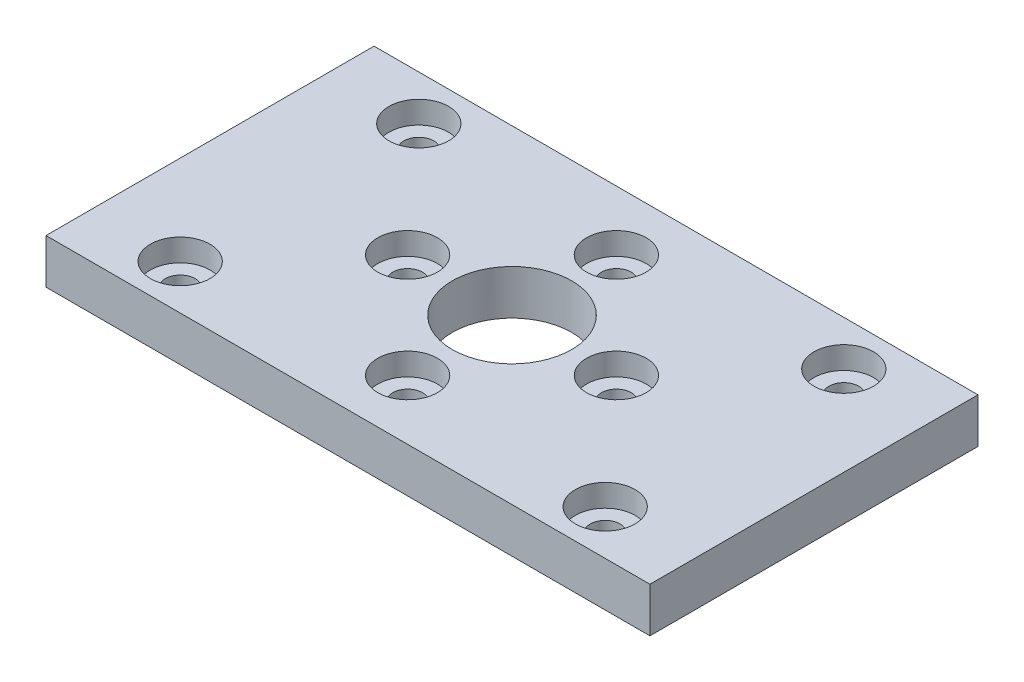
ISO-10303-21;
HEADER;
FILE_DESCRIPTION(('STEP AP214'),'2;1');
FILE_NAME('part.step','',(''),(''),'','','');
FILE_SCHEMA(('AUTOMOTIVE_DESIGN { 1 0 10303 214 1 1 1 1 }'));
ENDSEC;
DATA;
#1=APPLICATION_CONTEXT('core data for automotive mechanical design processes');
#2=APPLICATION_PROTOCOL_DEFINITION('international standard','automotive_design',2000,#1);
#3=PRODUCT_CONTEXT('',#1,'mechanical');
#4=PRODUCT('Part','Part','',(#3));
#5=PRODUCT_RELATED_PRODUCT_CATEGORY('part','',(#4));
#6=PRODUCT_DEFINITION_FORMATION('','',#4);
#7=PRODUCT_DEFINITION_CONTEXT('part definition',#1,'design');
#8=PRODUCT_DEFINITION('design','',#6,#7);
#9=PRODUCT_DEFINITION_SHAPE('','',#8);
#10=(LENGTH_UNIT() NAMED_UNIT(*) SI_UNIT(.MILLI.,.METRE.));
#11=(NAMED_UNIT(*) PLANE_ANGLE_UNIT() SI_UNIT($,.RADIAN.));
#12=(NAMED_UNIT(*) SI_UNIT($,.STERADIAN.) SOLID_ANGLE_UNIT());
#13=UNCERTAINTY_MEASURE_WITH_UNIT(LENGTH_MEASURE(1.E-05),#10,'distance_accuracy_value','');
#14=(GEOMETRIC_REPRESENTATION_CONTEXT(3) GLOBAL_UNCERTAINTY_ASSIGNED_CONTEXT((#13)) GLOBAL_UNIT_ASSIGNED_CONTEXT((#10,
#11,#12)) REPRESENTATION_CONTEXT('',''));
#15=CARTESIAN_POINT('',(0.,0.,0.));
#16=DIRECTION('',(0.,0.,1.));
#17=DIRECTION('',(1.,0.,0.));
#18=AXIS2_PLACEMENT_3D('',#15,#16,#17);
#19=CARTESIAN_POINT('',(14.25,-7.,8.));
#20=DIRECTION('',(0.,1.,0.));
#21=DIRECTION('',(0.,0.,1.));
#22=AXIS2_PLACEMENT_3D('',#19,#20,#21);
#23=CYLINDRICAL_SURFACE('',#22,1.);
#24=CARTESIAN_POINT('',(14.25,0.,8.));
#25=DIRECTION('',(0.,-1.,0.));
#26=DIRECTION('',(0.,0.,-1.));
#27=AXIS2_PLACEMENT_3D('',#24,#25,#26);
#28=CIRCLE('',#27,1.);
#29=CARTESIAN_POINT('',(14.25,0.,7.));
#30=VERTEX_POINT('',#29);
#31=EDGE_CURVE('E116',#30,#30,#28,.T.);
#32=ORIENTED_EDGE('',*,*,#31,.T.);
#33=EDGE_LOOP('',(#32));
#34=FACE_BOUND('',#33,.T.);
#35=CARTESIAN_POINT('',(14.25,1.5,8.));
#36=DIRECTION('',(0.,1.,0.));
#37=DIRECTION('',(0.,0.,1.));
#38=AXIS2_PLACEMENT_3D('',#35,#36,#37);
#39=CIRCLE('',#38,1.);
#40=CARTESIAN_POINT('',(14.25,1.5,9.));
#41=VERTEX_POINT('',#40);
#42=EDGE_CURVE('E156',#41,#41,#39,.F.);
#43=ORIENTED_EDGE('',*,*,#42,.F.);
#44=EDGE_LOOP('',(#43));
#45=FACE_BOUND('',#44,.T.);
#46=ADVANCED_FACE('F34',(#34,#45),#23,.F.);
#47=CARTESIAN_POINT('',(-14.25,-7.,8.));
#48=DIRECTION('',(0.,1.,0.));
#49=DIRECTION('',(0.,0.,1.));
#50=AXIS2_PLACEMENT_3D('',#47,#48,#49);
#51=CYLINDRICAL_SURFACE('',#50,1.);
#52=CARTESIAN_POINT('',(-14.25,0.,8.));
#53=DIRECTION('',(0.,-1.,0.));
#54=DIRECTION('',(0.,0.,-1.));
#55=AXIS2_PLACEMENT_3D('',#52,#53,#54);
#56=CIRCLE('',#55,1.);
#57=CARTESIAN_POINT('',(-14.25,0.,7.));
#58=VERTEX_POINT('',#57);
#59=EDGE_CURVE('E112',#58,#58,#56,.T.);
#60=ORIENTED_EDGE('',*,*,#59,.T.);
#61=EDGE_LOOP('',(#60));
#62=FACE_BOUND('',#61,.T.);
#63=CARTESIAN_POINT('',(-14.25,1.5,8.));
#64=DIRECTION('',(0.,1.,0.));
#65=DIRECTION('',(0.,0.,1.));
#66=AXIS2_PLACEMENT_3D('',#63,#64,#65);
#67=CIRCLE('',#66,1.);
#68=CARTESIAN_POINT('',(-14.25,1.5,9.));
#69=VERTEX_POINT('',#68);
#70=EDGE_CURVE('E154',#69,#69,#67,.F.);
#71=ORIENTED_EDGE('',*,*,#70,.F.);
#72=EDGE_LOOP('',(#71));
#73=FACE_BOUND('',#72,.T.);
#74=ADVANCED_FACE('F194',(#62,#73),#51,.F.);
#75=CARTESIAN_POINT('',(-6.9999999999998,-7.,1.98951966012828E-13));
#76=DIRECTION('',(0.,1.,0.));
#77=DIRECTION('',(0.,0.,1.));
#78=AXIS2_PLACEMENT_3D('',#75,#76,#77);
#79=CYLINDRICAL_SURFACE('',#78,1.00000000000032);
#80=CARTESIAN_POINT('',(-6.9999999999998,0.,1.98951966012828E-13));
#81=DIRECTION('',(0.,-1.,0.));
#82=DIRECTION('',(0.,0.,-1.));
#83=AXIS2_PLACEMENT_3D('',#80,#81,#82);
#84=CIRCLE('',#83,1.00000000000032);
#85=CARTESIAN_POINT('',(-6.9999999999998,0.,-1.00000000000012));
#86=VERTEX_POINT('',#85);
#87=EDGE_CURVE('E129',#86,#86,#84,.T.);
#88=ORIENTED_EDGE('',*,*,#87,.T.);
#89=EDGE_LOOP('',(#88));
#90=FACE_BOUND('',#89,.T.);
#91=CARTESIAN_POINT('',(-6.9999999999998,1.5,1.98951966012828E-13));
#92=DIRECTION('',(0.,1.,0.));
#93=DIRECTION('',(0.,0.,1.));
#94=AXIS2_PLACEMENT_3D('',#91,#92,#93);
#95=CIRCLE('',#94,1.00000000000032);
#96=CARTESIAN_POINT('',(-6.9999999999998,1.5,1.00000000000052));
#97=VERTEX_POINT('',#96);
#98=EDGE_CURVE('E148',#97,#97,#95,.F.);
#99=ORIENTED_EDGE('',*,*,#98,.F.);
#100=EDGE_LOOP('',(#99));
#101=FACE_BOUND('',#100,.T.);
#102=ADVANCED_FACE('F200',(#90,#101),#79,.F.);
#103=CARTESIAN_POINT('',(3.9618942650685E-13,-7.,7.));
#104=DIRECTION('',(0.,1.,0.));
#105=DIRECTION('',(0.,0.,1.));
#106=AXIS2_PLACEMENT_3D('',#103,#104,#105);
#107=CYLINDRICAL_SURFACE('',#106,1.00000000000043);
#108=CARTESIAN_POINT('',(3.9618942650685E-13,0.,7.));
#109=DIRECTION('',(0.,-1.,0.));
#110=DIRECTION('',(0.,0.,-1.));
#111=AXIS2_PLACEMENT_3D('',#108,#109,#110);
#112=CIRCLE('',#111,1.00000000000043);
#113=CARTESIAN_POINT('',(3.9618942650685E-13,0.,5.99999999999957));
#114=VERTEX_POINT('',#113);
#115=EDGE_CURVE('E132',#114,#114,#112,.T.);
#116=ORIENTED_EDGE('',*,*,#115,.T.);
#117=EDGE_LOOP('',(#116));
#118=FACE_BOUND('',#117,.T.);
#119=CARTESIAN_POINT('',(3.9618942650685E-13,1.5,7.));
#120=DIRECTION('',(0.,1.,0.));
#121=DIRECTION('',(0.,0.,1.));
#122=AXIS2_PLACEMENT_3D('',#119,#120,#121);
#123=CIRCLE('',#122,1.00000000000043);
#124=CARTESIAN_POINT('',(3.9618942650685E-13,1.5,8.00000000000042));
#125=VERTEX_POINT('',#124);
#126=EDGE_CURVE('E144',#125,#125,#123,.F.);
#127=ORIENTED_EDGE('',*,*,#126,.F.);
#128=EDGE_LOOP('',(#127));
#129=FACE_BOUND('',#128,.T.);
#130=ADVANCED_FACE('F224',(#118,#129),#107,.F.);
#131=CARTESIAN_POINT('',(7.0000000000002,-7.,-1.98094713253425E-13));
#132=DIRECTION('',(0.,1.,0.));
#133=DIRECTION('',(0.,0.,1.));
#134=AXIS2_PLACEMENT_3D('',#131,#132,#133);
#135=CYLINDRICAL_SURFACE('',#134,1.00000000000015);
#136=CARTESIAN_POINT('',(7.0000000000002,0.,-1.98094713253425E-13));
#137=DIRECTION('',(0.,-1.,0.));
#138=DIRECTION('',(0.,0.,-1.));
#139=AXIS2_PLACEMENT_3D('',#136,#137,#138);
#140=CIRCLE('',#139,1.00000000000015);
#141=CARTESIAN_POINT('',(7.0000000000002,0.,-1.00000000000035));
#142=VERTEX_POINT('',#141);
#143=EDGE_CURVE('E128',#142,#142,#140,.T.);
#144=ORIENTED_EDGE('',*,*,#143,.T.);
#145=EDGE_LOOP('',(#144));
#146=FACE_BOUND('',#145,.T.);
#147=CARTESIAN_POINT('',(7.0000000000002,1.5,-1.98094713253425E-13));
#148=DIRECTION('',(0.,1.,0.));
#149=DIRECTION('',(0.,0.,1.));
#150=AXIS2_PLACEMENT_3D('',#147,#148,#149);
#151=CIRCLE('',#150,1.00000000000015);
#152=CARTESIAN_POINT('',(7.0000000000002,1.5,0.999999999999957));
#153=VERTEX_POINT('',#152);
#154=EDGE_CURVE('E141',#153,#153,#151,.F.);
#155=ORIENTED_EDGE('',*,*,#154,.F.);
#156=EDGE_LOOP('',(#155));
#157=FACE_BOUND('',#156,.T.);
#158=ADVANCED_FACE('F219',(#146,#157),#135,.F.);
#159=CARTESIAN_POINT('',(20.25,3.,11.));
#160=DIRECTION('',(-1.,0.,0.));
#161=DIRECTION('',(0.,0.,1.));
#162=AXIS2_PLACEMENT_3D('',#159,#160,#161);
#163=PLANE('',#162);
#164=DIRECTION('',(0.,0.,-1.));
#165=VECTOR('',#164,1.);
#166=CARTESIAN_POINT('',(20.25,0.,11.));
#167=LINE('',#166,#165);
#168=CARTESIAN_POINT('',(20.25,0.,11.));
#169=VERTEX_POINT('',#168);
#170=CARTESIAN_POINT('',(20.25,0.,-11.));
#171=VERTEX_POINT('',#170);
#172=EDGE_CURVE('E101',#169,#171,#167,.T.);
#173=ORIENTED_EDGE('',*,*,#172,.T.);
#174=DIRECTION('',(0.,-1.,0.));
#175=VECTOR('',#174,1.);
#176=CARTESIAN_POINT('',(20.25,3.,-11.));
#177=LINE('',#176,#175);
#178=CARTESIAN_POINT('',(20.25,3.,-11.));
#179=VERTEX_POINT('',#178);
#180=EDGE_CURVE('E11',#179,#171,#177,.T.);
#181=ORIENTED_EDGE('',*,*,#180,.F.);
#182=DIRECTION('',(0.,0.,-1.));
#183=VECTOR('',#182,1.);
#184=CARTESIAN_POINT('',(20.25,3.,11.));
#185=LINE('',#184,#183);
#186=CARTESIAN_POINT('',(20.25,3.,11.));
#187=VERTEX_POINT('',#186);
#188=EDGE_CURVE('E88',#187,#179,#185,.T.);
#189=ORIENTED_EDGE('',*,*,#188,.F.);
#190=DIRECTION('',(0.,-1.,0.));
#191=VECTOR('',#190,1.);
#192=CARTESIAN_POINT('',(20.25,3.,11.));
#193=LINE('',#192,#191);
#194=EDGE_CURVE('E97',#187,#169,#193,.T.);
#195=ORIENTED_EDGE('',*,*,#194,.T.);
#196=EDGE_LOOP('',(#173,#181,#189,#195));
#197=FACE_BOUND('',#196,.T.);
#198=ADVANCED_FACE('F36',(#197),#163,.F.);
#199=CARTESIAN_POINT('',(-20.25,3.,-11.));
#200=DIRECTION('',(0.,0.,1.));
#201=DIRECTION('',(1.,0.,0.));
#202=AXIS2_PLACEMENT_3D('',#199,#200,#201);
#203=PLANE('',#202);
#204=DIRECTION('',(-1.,0.,0.));
#205=VECTOR('',#204,1.);
#206=CARTESIAN_POINT('',(-20.25,0.,-11.));
#207=LINE('',#206,#205);
#208=CARTESIAN_POINT('',(-20.25,0.,-11.));
#209=VERTEX_POINT('',#208);
#210=EDGE_CURVE('E92',#171,#209,#207,.T.);
#211=ORIENTED_EDGE('',*,*,#210,.T.);
#212=DIRECTION('',(0.,-1.,0.));
#213=VECTOR('',#212,1.);
#214=CARTESIAN_POINT('',(-20.25,3.,-11.));
#215=LINE('',#214,#213);
#216=CARTESIAN_POINT('',(-20.25,3.,-11.));
#217=VERTEX_POINT('',#216);
#218=EDGE_CURVE('E44',#217,#209,#215,.T.);
#219=ORIENTED_EDGE('',*,*,#218,.F.);
#220=DIRECTION('',(-1.,0.,0.));
#221=VECTOR('',#220,1.);
#222=CARTESIAN_POINT('',(-20.25,3.,-11.));
#223=LINE('',#222,#221);
#224=EDGE_CURVE('E83',#179,#217,#223,.T.);
#225=ORIENTED_EDGE('',*,*,#224,.F.);
#226=ORIENTED_EDGE('',*,*,#180,.T.);
#227=EDGE_LOOP('',(#211,#219,#225,#226));
#228=FACE_BOUND('',#227,.T.);
#229=ADVANCED_FACE('F91',(#228),#203,.F.);
#230=CARTESIAN_POINT('',(-20.25,3.,11.));
#231=DIRECTION('',(1.,0.,0.));
#232=DIRECTION('',(0.,0.,-1.));
#233=AXIS2_PLACEMENT_3D('',#230,#231,#232);
#234=PLANE('',#233);
#235=DIRECTION('',(0.,0.,1.));
#236=VECTOR('',#235,1.);
#237=CARTESIAN_POINT('',(-20.25,0.,11.));
#238=LINE('',#237,#236);
#239=CARTESIAN_POINT('',(-20.25,0.,11.));
#240=VERTEX_POINT('',#239);
#241=EDGE_CURVE('E70',#209,#240,#238,.T.);
#242=ORIENTED_EDGE('',*,*,#241,.T.);
#243=DIRECTION('',(0.,-1.,0.));
#244=VECTOR('',#243,1.);
#245=CARTESIAN_POINT('',(-20.25,3.,11.));
#246=LINE('',#245,#244);
#247=CARTESIAN_POINT('',(-20.25,3.,11.));
#248=VERTEX_POINT('',#247);
#249=EDGE_CURVE('E93',#248,#240,#246,.T.);
#250=ORIENTED_EDGE('',*,*,#249,.F.);
#251=DIRECTION('',(0.,0.,1.));
#252=VECTOR('',#251,1.);
#253=CARTESIAN_POINT('',(-20.25,3.,11.));
#254=LINE('',#253,#252);
#255=EDGE_CURVE('E86',#217,#248,#254,.T.);
#256=ORIENTED_EDGE('',*,*,#255,.F.);
#257=ORIENTED_EDGE('',*,*,#218,.T.);
#258=EDGE_LOOP('',(#242,#250,#256,#257));
#259=FACE_BOUND('',#258,.T.);
#260=ADVANCED_FACE('F95',(#259),#234,.F.);
#261=CARTESIAN_POINT('',(-20.25,3.,11.));
#262=DIRECTION('',(0.,0.,-1.));
#263=DIRECTION('',(-1.,0.,0.));
#264=AXIS2_PLACEMENT_3D('',#261,#262,#263);
#265=PLANE('',#264);
#266=DIRECTION('',(1.,0.,0.));
#267=VECTOR('',#266,1.);
#268=CARTESIAN_POINT('',(-20.25,0.,11.));
#269=LINE('',#268,#267);
#270=EDGE_CURVE('E76',#240,#169,#269,.T.);
#271=ORIENTED_EDGE('',*,*,#270,.T.);
#272=ORIENTED_EDGE('',*,*,#194,.F.);
#273=DIRECTION('',(1.,0.,0.));
#274=VECTOR('',#273,1.);
#275=CARTESIAN_POINT('',(-20.25,3.,11.));
#276=LINE('',#275,#274);
#277=EDGE_CURVE('E53',#248,#187,#276,.T.);
#278=ORIENTED_EDGE('',*,*,#277,.F.);
#279=ORIENTED_EDGE('',*,*,#249,.T.);
#280=EDGE_LOOP('',(#271,#272,#278,#279));
#281=FACE_BOUND('',#280,.T.);
#282=ADVANCED_FACE('F179',(#281),#265,.F.);
#283=CARTESIAN_POINT('',(0.,3.,0.));
#284=DIRECTION('',(0.,-1.,0.));
#285=DIRECTION('',(0.,0.,-1.));
#286=AXIS2_PLACEMENT_3D('',#283,#284,#285);
#287=PLANE('',#286);
#288=CARTESIAN_POINT('',(-14.25,3.,8.));
#289=DIRECTION('',(0.,1.,0.));
#290=DIRECTION('',(0.,0.,1.));
#291=AXIS2_PLACEMENT_3D('',#288,#289,#290);
#292=CIRCLE('',#291,2.);
#293=CARTESIAN_POINT('',(-14.25,3.,10.));
#294=VERTEX_POINT('',#293);
#295=EDGE_CURVE('E416',#294,#294,#292,.T.);
#296=ORIENTED_EDGE('',*,*,#295,.F.);
#297=EDGE_LOOP('',(#296));
#298=FACE_BOUND('',#297,.T.);
#299=CARTESIAN_POINT('',(3.9618942650685E-13,3.,7.));
#300=DIRECTION('',(0.,1.,0.));
#301=DIRECTION('',(0.,0.,1.));
#302=AXIS2_PLACEMENT_3D('',#299,#300,#301);
#303=CIRCLE('',#302,2.);
#304=CARTESIAN_POINT('',(3.9618942650685E-13,3.,9.));
#305=VERTEX_POINT('',#304);
#306=EDGE_CURVE('E422',#305,#305,#303,.T.);
#307=ORIENTED_EDGE('',*,*,#306,.F.);
#308=EDGE_LOOP('',(#307));
#309=FACE_BOUND('',#308,.T.);
#310=CARTESIAN_POINT('',(14.25,3.,8.));
#311=DIRECTION('',(0.,1.,0.));
#312=DIRECTION('',(0.,0.,1.));
#313=AXIS2_PLACEMENT_3D('',#310,#311,#312);
#314=CIRCLE('',#313,2.);
#315=CARTESIAN_POINT('',(14.25,3.,10.));
#316=VERTEX_POINT('',#315);
#317=EDGE_CURVE('E409',#316,#316,#314,.T.);
#318=ORIENTED_EDGE('',*,*,#317,.F.);
#319=EDGE_LOOP('',(#318));
#320=FACE_BOUND('',#319,.T.);
#321=CARTESIAN_POINT('',(-14.2500000000001,3.,-7.99999999999969));
#322=DIRECTION('',(0.,1.,0.));
#323=DIRECTION('',(0.,0.,-1.));
#324=AXIS2_PLACEMENT_3D('',#321,#322,#323);
#325=CIRCLE('',#324,2.);
#326=CARTESIAN_POINT('',(-14.2500000000001,3.,-9.99999999999969));
#327=VERTEX_POINT('',#326);
#328=EDGE_CURVE('E406',#327,#327,#325,.T.);
#329=ORIENTED_EDGE('',*,*,#328,.F.);
#330=EDGE_LOOP('',(#329));
#331=FACE_BOUND('',#330,.T.);
#332=CARTESIAN_POINT('',(-6.9999999999998,3.,1.98951966012828E-13));
#333=DIRECTION('',(0.,1.,0.));
#334=DIRECTION('',(0.,0.,1.));
#335=AXIS2_PLACEMENT_3D('',#332,#333,#334);
#336=CIRCLE('',#335,2.);
#337=CARTESIAN_POINT('',(-6.9999999999998,3.,2.0000000000002));
#338=VERTEX_POINT('',#337);
#339=EDGE_CURVE('E415',#338,#338,#336,.T.);
#340=ORIENTED_EDGE('',*,*,#339,.F.);
#341=EDGE_LOOP('',(#340));
#342=FACE_BOUND('',#341,.T.);
#343=CARTESIAN_POINT('',(7.0000000000002,3.,-1.98094713253425E-13));
#344=DIRECTION('',(0.,1.,0.));
#345=DIRECTION('',(0.,0.,1.));
#346=AXIS2_PLACEMENT_3D('',#343,#344,#345);
#347=CIRCLE('',#346,2.);
#348=CARTESIAN_POINT('',(7.0000000000002,3.,1.9999999999998));
#349=VERTEX_POINT('',#348);
#350=EDGE_CURVE('E434',#349,#349,#347,.T.);
#351=ORIENTED_EDGE('',*,*,#350,.F.);
#352=EDGE_LOOP('',(#351));
#353=FACE_BOUND('',#352,.T.);
#354=CARTESIAN_POINT('',(3.40678275275592E-13,3.,-6.99999999999981));
#355=DIRECTION('',(0.,1.,0.));
#356=DIRECTION('',(0.,0.,-1.));
#357=AXIS2_PLACEMENT_3D('',#354,#355,#356);
#358=CIRCLE('',#357,2.);
#359=CARTESIAN_POINT('',(3.40678275275592E-13,3.,-8.99999999999981));
#360=VERTEX_POINT('',#359);
#361=EDGE_CURVE('E428',#360,#360,#358,.T.);
#362=ORIENTED_EDGE('',*,*,#361,.F.);
#363=EDGE_LOOP('',(#362));
#364=FACE_BOUND('',#363,.T.);
#365=CARTESIAN_POINT('',(14.2499999999999,3.,-7.99999999999992));
#366=DIRECTION('',(0.,1.,0.));
#367=DIRECTION('',(0.,0.,-1.));
#368=AXIS2_PLACEMENT_3D('',#365,#366,#367);
#369=CIRCLE('',#368,2.);
#370=CARTESIAN_POINT('',(14.2499999999999,3.,-9.99999999999991));
#371=VERTEX_POINT('',#370);
#372=EDGE_CURVE('E161',#371,#371,#369,.T.);
#373=ORIENTED_EDGE('',*,*,#372,.F.);
#374=EDGE_LOOP('',(#373));
#375=FACE_BOUND('',#374,.T.);
#376=CARTESIAN_POINT('',(0.,3.,0.));
#377=DIRECTION('',(0.,1.,0.));
#378=DIRECTION('',(0.,0.,1.));
#379=AXIS2_PLACEMENT_3D('',#376,#377,#378);
#380=CIRCLE('',#379,4.);
#381=CARTESIAN_POINT('',(0.,3.,4.));
#382=VERTEX_POINT('',#381);
#383=EDGE_CURVE('E124',#382,#382,#380,.T.);
#384=ORIENTED_EDGE('',*,*,#383,.F.);
#385=EDGE_LOOP('',(#384));
#386=FACE_BOUND('',#385,.T.);
#387=ORIENTED_EDGE('',*,*,#188,.T.);
#388=ORIENTED_EDGE('',*,*,#224,.T.);
#389=ORIENTED_EDGE('',*,*,#255,.T.);
#390=ORIENTED_EDGE('',*,*,#277,.T.);
#391=EDGE_LOOP('',(#387,#388,#389,#390));
#392=FACE_BOUND('',#391,.T.);
#393=ADVANCED_FACE('F84',(#298,#309,#320,#331,#342,#353,#364,#375,#386,#392),#287,.F.);
#394=CARTESIAN_POINT('',(0.,0.,0.));
#395=DIRECTION('',(0.,-1.,0.));
#396=DIRECTION('',(0.,0.,-1.));
#397=AXIS2_PLACEMENT_3D('',#394,#395,#396);
#398=PLANE('',#397);
#399=ORIENTED_EDGE('',*,*,#143,.F.);
#400=EDGE_LOOP('',(#399));
#401=FACE_BOUND('',#400,.T.);
#402=ORIENTED_EDGE('',*,*,#115,.F.);
#403=EDGE_LOOP('',(#402));
#404=FACE_BOUND('',#403,.T.);
#405=ORIENTED_EDGE('',*,*,#87,.F.);
#406=EDGE_LOOP('',(#405));
#407=FACE_BOUND('',#406,.T.);
#408=CARTESIAN_POINT('',(0.,0.,-7.));
#409=DIRECTION('',(0.,-1.,0.));
#410=DIRECTION('',(0.,0.,-1.));
#411=AXIS2_PLACEMENT_3D('',#408,#409,#410);
#412=CIRCLE('',#411,1.);
#413=CARTESIAN_POINT('',(0.,0.,-8.));
#414=VERTEX_POINT('',#413);
#415=EDGE_CURVE('E125',#414,#414,#412,.T.);
#416=ORIENTED_EDGE('',*,*,#415,.F.);
#417=EDGE_LOOP('',(#416));
#418=FACE_BOUND('',#417,.T.);
#419=CARTESIAN_POINT('',(0.,0.,0.));
#420=DIRECTION('',(0.,-1.,0.));
#421=DIRECTION('',(0.,0.,-1.));
#422=AXIS2_PLACEMENT_3D('',#419,#420,#421);
#423=CIRCLE('',#422,4.);
#424=CARTESIAN_POINT('',(0.,0.,-4.));
#425=VERTEX_POINT('',#424);
#426=EDGE_CURVE('E117',#425,#425,#423,.T.);
#427=ORIENTED_EDGE('',*,*,#426,.F.);
#428=EDGE_LOOP('',(#427));
#429=FACE_BOUND('',#428,.T.);
#430=ORIENTED_EDGE('',*,*,#59,.F.);
#431=EDGE_LOOP('',(#430));
#432=FACE_BOUND('',#431,.T.);
#433=ORIENTED_EDGE('',*,*,#31,.F.);
#434=EDGE_LOOP('',(#433));
#435=FACE_BOUND('',#434,.T.);
#436=CARTESIAN_POINT('',(14.25,0.,-7.99999999999999));
#437=DIRECTION('',(0.,-1.,0.));
#438=DIRECTION('',(0.,0.,-1.));
#439=AXIS2_PLACEMENT_3D('',#436,#437,#438);
#440=CIRCLE('',#439,0.999999999999999);
#441=CARTESIAN_POINT('',(14.25,0.,-8.99999999999999));
#442=VERTEX_POINT('',#441);
#443=EDGE_CURVE('E113',#442,#442,#440,.T.);
#444=ORIENTED_EDGE('',*,*,#443,.F.);
#445=EDGE_LOOP('',(#444));
#446=FACE_BOUND('',#445,.T.);
#447=CARTESIAN_POINT('',(-14.25,0.,-8.));
#448=DIRECTION('',(0.,-1.,0.));
#449=DIRECTION('',(0.,0.,-1.));
#450=AXIS2_PLACEMENT_3D('',#447,#448,#449);
#451=CIRCLE('',#450,0.999999999999999);
#452=CARTESIAN_POINT('',(-14.25,0.,-9.));
#453=VERTEX_POINT('',#452);
#454=EDGE_CURVE('E104',#453,#453,#451,.T.);
#455=ORIENTED_EDGE('',*,*,#454,.F.);
#456=EDGE_LOOP('',(#455));
#457=FACE_BOUND('',#456,.T.);
#458=ORIENTED_EDGE('',*,*,#172,.F.);
#459=ORIENTED_EDGE('',*,*,#270,.F.);
#460=ORIENTED_EDGE('',*,*,#241,.F.);
#461=ORIENTED_EDGE('',*,*,#210,.F.);
#462=EDGE_LOOP('',(#458,#459,#460,#461));
#463=FACE_BOUND('',#462,.T.);
#464=ADVANCED_FACE('F178',(#401,#404,#407,#418,#429,#432,#435,#446,#457,#463),#398,.T.);
#465=CARTESIAN_POINT('',(-14.25,-7.,-8.));
#466=DIRECTION('',(0.,1.,0.));
#467=DIRECTION('',(0.,0.,1.));
#468=AXIS2_PLACEMENT_3D('',#465,#466,#467);
#469=CYLINDRICAL_SURFACE('',#468,0.999999999999999);
#470=CARTESIAN_POINT('',(-14.25,1.5,-8.));
#471=DIRECTION('',(0.,-1.,0.));
#472=DIRECTION('',(0.,0.,-1.));
#473=AXIS2_PLACEMENT_3D('',#470,#471,#472);
#474=CIRCLE('',#473,0.999999999999999);
#475=CARTESIAN_POINT('',(-14.25,1.5,-9.));
#476=VERTEX_POINT('',#475);
#477=EDGE_CURVE('E38',#476,#476,#474,.F.);
#478=ORIENTED_EDGE('',*,*,#477,.T.);
#479=EDGE_LOOP('',(#478));
#480=FACE_BOUND('',#479,.T.);
#481=ORIENTED_EDGE('',*,*,#454,.T.);
#482=EDGE_LOOP('',(#481));
#483=FACE_BOUND('',#482,.T.);
#484=ADVANCED_FACE('F186',(#480,#483),#469,.F.);
#485=CARTESIAN_POINT('',(14.25,-7.,-7.99999999999999));
#486=DIRECTION('',(0.,1.,0.));
#487=DIRECTION('',(0.,0.,1.));
#488=AXIS2_PLACEMENT_3D('',#485,#486,#487);
#489=CYLINDRICAL_SURFACE('',#488,0.999999999999999);
#490=CARTESIAN_POINT('',(14.25,1.5,-7.99999999999999));
#491=DIRECTION('',(0.,-1.,0.));
#492=DIRECTION('',(0.,0.,-1.));
#493=AXIS2_PLACEMENT_3D('',#490,#491,#492);
#494=CIRCLE('',#493,0.999999999999999);
#495=CARTESIAN_POINT('',(14.25,1.5,-8.99999999999999));
#496=VERTEX_POINT('',#495);
#497=EDGE_CURVE('E133',#496,#496,#494,.F.);
#498=ORIENTED_EDGE('',*,*,#497,.T.);
#499=EDGE_LOOP('',(#498));
#500=FACE_BOUND('',#499,.T.);
#501=ORIENTED_EDGE('',*,*,#443,.T.);
#502=EDGE_LOOP('',(#501));
#503=FACE_BOUND('',#502,.T.);
#504=ADVANCED_FACE('F206',(#500,#503),#489,.F.);
#505=CARTESIAN_POINT('',(0.,-7.,0.));
#506=DIRECTION('',(0.,1.,0.));
#507=DIRECTION('',(0.,0.,1.));
#508=AXIS2_PLACEMENT_3D('',#505,#506,#507);
#509=CYLINDRICAL_SURFACE('',#508,4.);
#510=ORIENTED_EDGE('',*,*,#426,.T.);
#511=EDGE_LOOP('',(#510));
#512=FACE_BOUND('',#511,.T.);
#513=ORIENTED_EDGE('',*,*,#383,.T.);
#514=EDGE_LOOP('',(#513));
#515=FACE_BOUND('',#514,.T.);
#516=ADVANCED_FACE('F175',(#512,#515),#509,.F.);
#517=CARTESIAN_POINT('',(0.,-7.,-7.));
#518=DIRECTION('',(0.,1.,0.));
#519=DIRECTION('',(0.,0.,1.));
#520=AXIS2_PLACEMENT_3D('',#517,#518,#519);
#521=CYLINDRICAL_SURFACE('',#520,1.);
#522=CARTESIAN_POINT('',(0.,1.5,-7.));
#523=DIRECTION('',(0.,-1.,0.));
#524=DIRECTION('',(0.,0.,-1.));
#525=AXIS2_PLACEMENT_3D('',#522,#523,#524);
#526=CIRCLE('',#525,1.);
#527=CARTESIAN_POINT('',(0.,1.5,-8.));
#528=VERTEX_POINT('',#527);
#529=EDGE_CURVE('E151',#528,#528,#526,.F.);
#530=ORIENTED_EDGE('',*,*,#529,.T.);
#531=EDGE_LOOP('',(#530));
#532=FACE_BOUND('',#531,.T.);
#533=ORIENTED_EDGE('',*,*,#415,.T.);
#534=EDGE_LOOP('',(#533));
#535=FACE_BOUND('',#534,.T.);
#536=ADVANCED_FACE('F240',(#532,#535),#521,.F.);
#537=CARTESIAN_POINT('',(14.2499999999999,1.5,-7.99999999999992));
#538=DIRECTION('',(0.,-1.,0.));
#539=DIRECTION('',(0.,0.,-1.));
#540=AXIS2_PLACEMENT_3D('',#537,#538,#539);
#541=PLANE('',#540);
#542=CARTESIAN_POINT('',(14.2499999999999,1.5,-7.99999999999992));
#543=DIRECTION('',(0.,1.,0.));
#544=DIRECTION('',(0.,0.,-1.));
#545=AXIS2_PLACEMENT_3D('',#542,#543,#544);
#546=CIRCLE('',#545,2.);
#547=CARTESIAN_POINT('',(14.2499999999999,1.5,-9.99999999999991));
#548=VERTEX_POINT('',#547);
#549=EDGE_CURVE('E140',#548,#548,#546,.T.);
#550=ORIENTED_EDGE('',*,*,#549,.T.);
#551=EDGE_LOOP('',(#550));
#552=FACE_BOUND('',#551,.T.);
#553=ORIENTED_EDGE('',*,*,#497,.F.);
#554=EDGE_LOOP('',(#553));
#555=FACE_BOUND('',#554,.T.);
#556=ADVANCED_FACE('F242',(#552,#555),#541,.F.);
#557=CARTESIAN_POINT('',(14.2499999999999,1.5,-7.99999999999992));
#558=DIRECTION('',(0.,1.,0.));
#559=DIRECTION('',(0.,0.,1.));
#560=AXIS2_PLACEMENT_3D('',#557,#558,#559);
#561=CYLINDRICAL_SURFACE('',#560,2.);
#562=ORIENTED_EDGE('',*,*,#549,.F.);
#563=EDGE_LOOP('',(#562));
#564=FACE_BOUND('',#563,.T.);
#565=ORIENTED_EDGE('',*,*,#372,.T.);
#566=EDGE_LOOP('',(#565));
#567=FACE_BOUND('',#566,.T.);
#568=ADVANCED_FACE('F234',(#564,#567),#561,.F.);
#569=CARTESIAN_POINT('',(7.0000000000002,1.5,-1.98094713253425E-13));
#570=DIRECTION('',(0.,1.,0.));
#571=DIRECTION('',(0.,0.,1.));
#572=AXIS2_PLACEMENT_3D('',#569,#570,#571);
#573=PLANE('',#572);
#574=CARTESIAN_POINT('',(7.0000000000002,1.5,-1.98094713253425E-13));
#575=DIRECTION('',(0.,1.,0.));
#576=DIRECTION('',(0.,0.,1.));
#577=AXIS2_PLACEMENT_3D('',#574,#575,#576);
#578=CIRCLE('',#577,2.);
#579=CARTESIAN_POINT('',(7.0000000000002,1.5,1.9999999999998));
#580=VERTEX_POINT('',#579);
#581=EDGE_CURVE('E431',#580,#580,#578,.T.);
#582=ORIENTED_EDGE('',*,*,#581,.T.);
#583=EDGE_LOOP('',(#582));
#584=FACE_BOUND('',#583,.T.);
#585=ORIENTED_EDGE('',*,*,#154,.T.);
#586=EDGE_LOOP('',(#585));
#587=FACE_BOUND('',#586,.T.);
#588=ADVANCED_FACE('F295',(#584,#587),#573,.T.);
#589=CARTESIAN_POINT('',(7.0000000000002,1.5,-1.98094713253425E-13));
#590=DIRECTION('',(0.,1.,0.));
#591=DIRECTION('',(0.,0.,1.));
#592=AXIS2_PLACEMENT_3D('',#589,#590,#591);
#593=CYLINDRICAL_SURFACE('',#592,2.);
#594=ORIENTED_EDGE('',*,*,#581,.F.);
#595=EDGE_LOOP('',(#594));
#596=FACE_BOUND('',#595,.T.);
#597=ORIENTED_EDGE('',*,*,#350,.T.);
#598=EDGE_LOOP('',(#597));
#599=FACE_BOUND('',#598,.T.);
#600=ADVANCED_FACE('F285',(#596,#599),#593,.F.);
#601=CARTESIAN_POINT('',(3.9618942650685E-13,1.5,7.));
#602=DIRECTION('',(0.,1.,0.));
#603=DIRECTION('',(0.,0.,1.));
#604=AXIS2_PLACEMENT_3D('',#601,#602,#603);
#605=PLANE('',#604);
#606=CARTESIAN_POINT('',(3.9618942650685E-13,1.5,7.));
#607=DIRECTION('',(0.,1.,0.));
#608=DIRECTION('',(0.,0.,1.));
#609=AXIS2_PLACEMENT_3D('',#606,#607,#608);
#610=CIRCLE('',#609,2.);
#611=CARTESIAN_POINT('',(3.9618942650685E-13,1.5,9.));
#612=VERTEX_POINT('',#611);
#613=EDGE_CURVE('E419',#612,#612,#610,.T.);
#614=ORIENTED_EDGE('',*,*,#613,.T.);
#615=EDGE_LOOP('',(#614));
#616=FACE_BOUND('',#615,.T.);
#617=ORIENTED_EDGE('',*,*,#126,.T.);
#618=EDGE_LOOP('',(#617));
#619=FACE_BOUND('',#618,.T.);
#620=ADVANCED_FACE('F281',(#616,#619),#605,.T.);
#621=CARTESIAN_POINT('',(3.9618942650685E-13,1.5,7.));
#622=DIRECTION('',(0.,1.,0.));
#623=DIRECTION('',(0.,0.,1.));
#624=AXIS2_PLACEMENT_3D('',#621,#622,#623);
#625=CYLINDRICAL_SURFACE('',#624,2.);
#626=ORIENTED_EDGE('',*,*,#613,.F.);
#627=EDGE_LOOP('',(#626));
#628=FACE_BOUND('',#627,.T.);
#629=ORIENTED_EDGE('',*,*,#306,.T.);
#630=EDGE_LOOP('',(#629));
#631=FACE_BOUND('',#630,.T.);
#632=ADVANCED_FACE('F284',(#628,#631),#625,.F.);
#633=CARTESIAN_POINT('',(-6.9999999999998,1.5,1.98951966012828E-13));
#634=DIRECTION('',(0.,1.,0.));
#635=DIRECTION('',(0.,0.,1.));
#636=AXIS2_PLACEMENT_3D('',#633,#634,#635);
#637=PLANE('',#636);
#638=CARTESIAN_POINT('',(-6.9999999999998,1.5,1.98951966012828E-13));
#639=DIRECTION('',(0.,1.,0.));
#640=DIRECTION('',(0.,0.,1.));
#641=AXIS2_PLACEMENT_3D('',#638,#639,#640);
#642=CIRCLE('',#641,2.);
#643=CARTESIAN_POINT('',(-6.9999999999998,1.5,2.0000000000002));
#644=VERTEX_POINT('',#643);
#645=EDGE_CURVE('E437',#644,#644,#642,.T.);
#646=ORIENTED_EDGE('',*,*,#645,.T.);
#647=EDGE_LOOP('',(#646));
#648=FACE_BOUND('',#647,.T.);
#649=ORIENTED_EDGE('',*,*,#98,.T.);
#650=EDGE_LOOP('',(#649));
#651=FACE_BOUND('',#650,.T.);
#652=ADVANCED_FACE('F289',(#648,#651),#637,.T.);
#653=CARTESIAN_POINT('',(-6.9999999999998,1.5,1.98951966012828E-13));
#654=DIRECTION('',(0.,1.,0.));
#655=DIRECTION('',(0.,0.,1.));
#656=AXIS2_PLACEMENT_3D('',#653,#654,#655);
#657=CYLINDRICAL_SURFACE('',#656,2.);
#658=ORIENTED_EDGE('',*,*,#645,.F.);
#659=EDGE_LOOP('',(#658));
#660=FACE_BOUND('',#659,.T.);
#661=ORIENTED_EDGE('',*,*,#339,.T.);
#662=EDGE_LOOP('',(#661));
#663=FACE_BOUND('',#662,.T.);
#664=ADVANCED_FACE('F292',(#660,#663),#657,.F.);
#665=CARTESIAN_POINT('',(3.40678275275592E-13,1.5,-6.99999999999981));
#666=DIRECTION('',(0.,-1.,0.));
#667=DIRECTION('',(0.,0.,-1.));
#668=AXIS2_PLACEMENT_3D('',#665,#666,#667);
#669=PLANE('',#668);
#670=CARTESIAN_POINT('',(3.40678275275592E-13,1.5,-6.99999999999981));
#671=DIRECTION('',(0.,1.,0.));
#672=DIRECTION('',(0.,0.,-1.));
#673=AXIS2_PLACEMENT_3D('',#670,#671,#672);
#674=CIRCLE('',#673,2.);
#675=CARTESIAN_POINT('',(3.40678275275592E-13,1.5,-8.99999999999981));
#676=VERTEX_POINT('',#675);
#677=EDGE_CURVE('E145',#676,#676,#674,.T.);
#678=ORIENTED_EDGE('',*,*,#677,.T.);
#679=EDGE_LOOP('',(#678));
#680=FACE_BOUND('',#679,.T.);
#681=ORIENTED_EDGE('',*,*,#529,.F.);
#682=EDGE_LOOP('',(#681));
#683=FACE_BOUND('',#682,.T.);
#684=ADVANCED_FACE('F273',(#680,#683),#669,.F.);
#685=CARTESIAN_POINT('',(3.40678275275592E-13,1.5,-6.99999999999981));
#686=DIRECTION('',(0.,1.,0.));
#687=DIRECTION('',(0.,0.,1.));
#688=AXIS2_PLACEMENT_3D('',#685,#686,#687);
#689=CYLINDRICAL_SURFACE('',#688,2.);
#690=ORIENTED_EDGE('',*,*,#677,.F.);
#691=EDGE_LOOP('',(#690));
#692=FACE_BOUND('',#691,.T.);
#693=ORIENTED_EDGE('',*,*,#361,.T.);
#694=EDGE_LOOP('',(#693));
#695=FACE_BOUND('',#694,.T.);
#696=ADVANCED_FACE('F263',(#692,#695),#689,.F.);
#697=CARTESIAN_POINT('',(-14.25,1.5,8.));
#698=DIRECTION('',(0.,1.,0.));
#699=DIRECTION('',(0.,0.,1.));
#700=AXIS2_PLACEMENT_3D('',#697,#698,#699);
#701=PLANE('',#700);
#702=CARTESIAN_POINT('',(-14.25,1.5,8.));
#703=DIRECTION('',(0.,1.,0.));
#704=DIRECTION('',(0.,0.,1.));
#705=AXIS2_PLACEMENT_3D('',#702,#703,#704);
#706=CIRCLE('',#705,2.);
#707=CARTESIAN_POINT('',(-14.25,1.5,10.));
#708=VERTEX_POINT('',#707);
#709=EDGE_CURVE('E413',#708,#708,#706,.T.);
#710=ORIENTED_EDGE('',*,*,#709,.T.);
#711=EDGE_LOOP('',(#710));
#712=FACE_BOUND('',#711,.T.);
#713=ORIENTED_EDGE('',*,*,#70,.T.);
#714=EDGE_LOOP('',(#713));
#715=FACE_BOUND('',#714,.T.);
#716=ADVANCED_FACE('F260',(#712,#715),#701,.T.);
#717=CARTESIAN_POINT('',(-14.25,1.5,8.));
#718=DIRECTION('',(0.,1.,0.));
#719=DIRECTION('',(0.,0.,1.));
#720=AXIS2_PLACEMENT_3D('',#717,#718,#719);
#721=CYLINDRICAL_SURFACE('',#720,2.);
#722=ORIENTED_EDGE('',*,*,#709,.F.);
#723=EDGE_LOOP('',(#722));
#724=FACE_BOUND('',#723,.T.);
#725=ORIENTED_EDGE('',*,*,#295,.T.);
#726=EDGE_LOOP('',(#725));
#727=FACE_BOUND('',#726,.T.);
#728=ADVANCED_FACE('F262',(#724,#727),#721,.F.);
#729=CARTESIAN_POINT('',(14.25,1.5,8.));
#730=DIRECTION('',(0.,1.,0.));
#731=DIRECTION('',(0.,0.,1.));
#732=AXIS2_PLACEMENT_3D('',#729,#730,#731);
#733=PLANE('',#732);
#734=CARTESIAN_POINT('',(14.25,1.5,8.));
#735=DIRECTION('',(0.,1.,0.));
#736=DIRECTION('',(0.,0.,1.));
#737=AXIS2_PLACEMENT_3D('',#734,#735,#736);
#738=CIRCLE('',#737,2.);
#739=CARTESIAN_POINT('',(14.25,1.5,10.));
#740=VERTEX_POINT('',#739);
#741=EDGE_CURVE('E425',#740,#740,#738,.T.);
#742=ORIENTED_EDGE('',*,*,#741,.T.);
#743=EDGE_LOOP('',(#742));
#744=FACE_BOUND('',#743,.T.);
#745=ORIENTED_EDGE('',*,*,#42,.T.);
#746=EDGE_LOOP('',(#745));
#747=FACE_BOUND('',#746,.T.);
#748=ADVANCED_FACE('F270',(#744,#747),#733,.T.);
#749=CARTESIAN_POINT('',(14.25,1.5,8.));
#750=DIRECTION('',(0.,1.,0.));
#751=DIRECTION('',(0.,0.,1.));
#752=AXIS2_PLACEMENT_3D('',#749,#750,#751);
#753=CYLINDRICAL_SURFACE('',#752,2.);
#754=ORIENTED_EDGE('',*,*,#741,.F.);
#755=EDGE_LOOP('',(#754));
#756=FACE_BOUND('',#755,.T.);
#757=ORIENTED_EDGE('',*,*,#317,.T.);
#758=EDGE_LOOP('',(#757));
#759=FACE_BOUND('',#758,.T.);
#760=ADVANCED_FACE('F369',(#756,#759),#753,.F.);
#761=CARTESIAN_POINT('',(-14.2500000000001,1.5,-7.99999999999969));
#762=DIRECTION('',(0.,-1.,0.));
#763=DIRECTION('',(0.,0.,-1.));
#764=AXIS2_PLACEMENT_3D('',#761,#762,#763);
#765=PLANE('',#764);
#766=CARTESIAN_POINT('',(-14.2500000000001,1.5,-7.99999999999969));
#767=DIRECTION('',(0.,1.,0.));
#768=DIRECTION('',(0.,0.,-1.));
#769=AXIS2_PLACEMENT_3D('',#766,#767,#768);
#770=CIRCLE('',#769,2.);
#771=CARTESIAN_POINT('',(-14.2500000000001,1.5,-9.99999999999969));
#772=VERTEX_POINT('',#771);
#773=EDGE_CURVE('E403',#772,#772,#770,.T.);
#774=ORIENTED_EDGE('',*,*,#773,.T.);
#775=EDGE_LOOP('',(#774));
#776=FACE_BOUND('',#775,.T.);
#777=ORIENTED_EDGE('',*,*,#477,.F.);
#778=EDGE_LOOP('',(#777));
#779=FACE_BOUND('',#778,.T.);
#780=ADVANCED_FACE('F379',(#776,#779),#765,.F.);
#781=CARTESIAN_POINT('',(-14.2500000000001,1.5,-7.99999999999969));
#782=DIRECTION('',(0.,1.,0.));
#783=DIRECTION('',(0.,0.,1.));
#784=AXIS2_PLACEMENT_3D('',#781,#782,#783);
#785=CYLINDRICAL_SURFACE('',#784,2.);
#786=ORIENTED_EDGE('',*,*,#773,.F.);
#787=EDGE_LOOP('',(#786));
#788=FACE_BOUND('',#787,.T.);
#789=ORIENTED_EDGE('',*,*,#328,.T.);
#790=EDGE_LOOP('',(#789));
#791=FACE_BOUND('',#790,.T.);
#792=ADVANCED_FACE('F278',(#788,#791),#785,.F.);
#793=CLOSED_SHELL('',(#46,#74,#102,#130,#158,#198,#229,#260,#282,#393,#464,#484,#504,#516,#536,
#556,#568,#588,#600,#620,#632,#652,#664,#684,#696,#716,#728,#748,#760,#780,#792));
#794=MANIFOLD_SOLID_BREP('B2',#793);
#795=ADVANCED_BREP_SHAPE_REPRESENTATION('',(#18,#794),#14);
#796=SHAPE_DEFINITION_REPRESENTATION(#9,#795);
ENDSEC;
END-ISO-10303-21;
